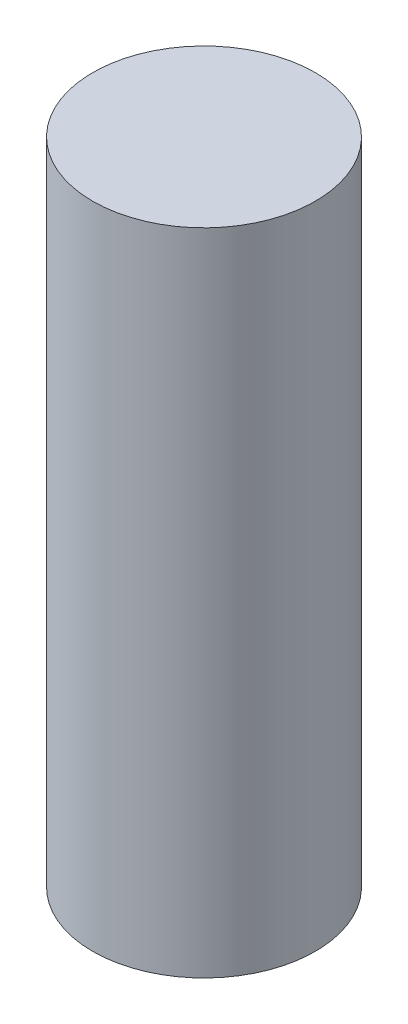
ISO-10303-21;
HEADER;
FILE_DESCRIPTION(('STEP AP214'),'2;1');
FILE_NAME('part.step','',(''),(''),'','','');
FILE_SCHEMA(('AUTOMOTIVE_DESIGN { 1 0 10303 214 1 1 1 1 }'));
ENDSEC;
DATA;
#1=APPLICATION_CONTEXT('core data for automotive mechanical design processes');
#2=APPLICATION_PROTOCOL_DEFINITION('international standard','automotive_design',2000,#1);
#3=PRODUCT_CONTEXT('',#1,'mechanical');
#4=PRODUCT('Part','Part','',(#3));
#5=PRODUCT_RELATED_PRODUCT_CATEGORY('part','',(#4));
#6=PRODUCT_DEFINITION_FORMATION('','',#4);
#7=PRODUCT_DEFINITION_CONTEXT('part definition',#1,'design');
#8=PRODUCT_DEFINITION('design','',#6,#7);
#9=PRODUCT_DEFINITION_SHAPE('','',#8);
#10=(LENGTH_UNIT() NAMED_UNIT(*) SI_UNIT(.MILLI.,.METRE.));
#11=(NAMED_UNIT(*) PLANE_ANGLE_UNIT() SI_UNIT($,.RADIAN.));
#12=(NAMED_UNIT(*) SI_UNIT($,.STERADIAN.) SOLID_ANGLE_UNIT());
#13=UNCERTAINTY_MEASURE_WITH_UNIT(LENGTH_MEASURE(1.E-05),#10,'distance_accuracy_value','');
#14=(GEOMETRIC_REPRESENTATION_CONTEXT(3) GLOBAL_UNCERTAINTY_ASSIGNED_CONTEXT((#13)) GLOBAL_UNIT_ASSIGNED_CONTEXT((#10,
#11,#12)) REPRESENTATION_CONTEXT('',''));
#15=CARTESIAN_POINT('',(0.,0.,0.));
#16=DIRECTION('',(0.,0.,1.));
#17=DIRECTION('',(1.,0.,0.));
#18=AXIS2_PLACEMENT_3D('',#15,#16,#17);
#19=CARTESIAN_POINT('',(-15.7661290322581,35.,-9.85383064516128));
#20=DIRECTION('',(0.,-1.,0.));
#21=DIRECTION('',(0.,0.,-1.));
#22=AXIS2_PLACEMENT_3D('',#19,#20,#21);
#23=CYLINDRICAL_SURFACE('',#22,6.);
#24=CARTESIAN_POINT('',(-15.7661290322581,35.,-9.85383064516128));
#25=DIRECTION('',(0.,1.,0.));
#26=DIRECTION('',(0.,0.,1.));
#27=AXIS2_PLACEMENT_3D('',#24,#25,#26);
#28=CIRCLE('',#27,6.);
#29=CARTESIAN_POINT('',(-15.7661290322581,35.,-3.85383064516128));
#30=VERTEX_POINT('',#29);
#31=EDGE_CURVE('E10',#30,#30,#28,.T.);
#32=ORIENTED_EDGE('',*,*,#31,.F.);
#33=EDGE_LOOP('',(#32));
#34=FACE_BOUND('',#33,.T.);
#35=CARTESIAN_POINT('',(-15.7661290322581,0.,-9.85383064516128));
#36=DIRECTION('',(0.,1.,0.));
#37=DIRECTION('',(0.,0.,1.));
#38=AXIS2_PLACEMENT_3D('',#35,#36,#37);
#39=CIRCLE('',#38,6.);
#40=CARTESIAN_POINT('',(-15.7661290322581,0.,-3.85383064516128));
#41=VERTEX_POINT('',#40);
#42=EDGE_CURVE('E34',#41,#41,#39,.T.);
#43=ORIENTED_EDGE('',*,*,#42,.T.);
#44=EDGE_LOOP('',(#43));
#45=FACE_BOUND('',#44,.T.);
#46=ADVANCED_FACE('F31',(#34,#45),#23,.T.);
#47=CARTESIAN_POINT('',(-15.7661290322581,35.,-9.85383064516128));
#48=DIRECTION('',(0.,1.,0.));
#49=DIRECTION('',(0.,0.,1.));
#50=AXIS2_PLACEMENT_3D('',#47,#48,#49);
#51=PLANE('',#50);
#52=ORIENTED_EDGE('',*,*,#31,.T.);
#53=EDGE_LOOP('',(#52));
#54=FACE_BOUND('',#53,.T.);
#55=ADVANCED_FACE('F46',(#54),#51,.T.);
#56=CARTESIAN_POINT('',(-15.7661290322581,0.,-9.85383064516128));
#57=DIRECTION('',(0.,1.,0.));
#58=DIRECTION('',(0.,0.,1.));
#59=AXIS2_PLACEMENT_3D('',#56,#57,#58);
#60=PLANE('',#59);
#61=ORIENTED_EDGE('',*,*,#42,.F.);
#62=EDGE_LOOP('',(#61));
#63=FACE_BOUND('',#62,.T.);
#64=ADVANCED_FACE('F44',(#63),#60,.F.);
#65=CLOSED_SHELL('',(#46,#55,#64));
#66=MANIFOLD_SOLID_BREP('B2',#65);
#67=ADVANCED_BREP_SHAPE_REPRESENTATION('',(#18,#66),#14);
#68=SHAPE_DEFINITION_REPRESENTATION(#9,#67);
ENDSEC;
END-ISO-10303-21;
